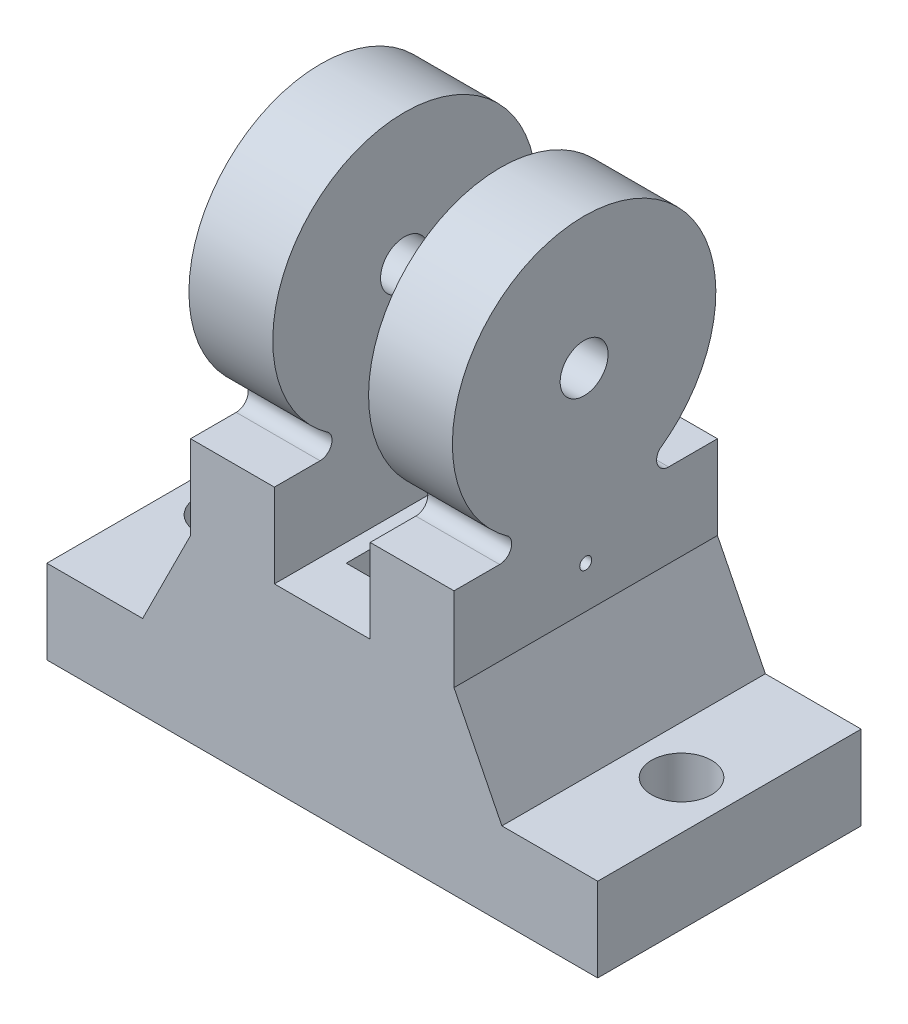
ISO-10303-21;
HEADER;
FILE_DESCRIPTION(('STEP AP214'),'2;1');
FILE_NAME('part.step','',(''),(''),'','','');
FILE_SCHEMA(('AUTOMOTIVE_DESIGN { 1 0 10303 214 1 1 1 1 }'));
ENDSEC;
DATA;
#1=APPLICATION_CONTEXT('core data for automotive mechanical design processes');
#2=APPLICATION_PROTOCOL_DEFINITION('international standard','automotive_design',2000,#1);
#3=PRODUCT_CONTEXT('',#1,'mechanical');
#4=PRODUCT('Part','Part','',(#3));
#5=PRODUCT_RELATED_PRODUCT_CATEGORY('part','',(#4));
#6=PRODUCT_DEFINITION_FORMATION('','',#4);
#7=PRODUCT_DEFINITION_CONTEXT('part definition',#1,'design');
#8=PRODUCT_DEFINITION('design','',#6,#7);
#9=PRODUCT_DEFINITION_SHAPE('','',#8);
#10=(LENGTH_UNIT() NAMED_UNIT(*) SI_UNIT(.MILLI.,.METRE.));
#11=(NAMED_UNIT(*) PLANE_ANGLE_UNIT() SI_UNIT($,.RADIAN.));
#12=(NAMED_UNIT(*) SI_UNIT($,.STERADIAN.) SOLID_ANGLE_UNIT());
#13=UNCERTAINTY_MEASURE_WITH_UNIT(LENGTH_MEASURE(1.E-05),#10,'distance_accuracy_value','');
#14=(GEOMETRIC_REPRESENTATION_CONTEXT(3) GLOBAL_UNCERTAINTY_ASSIGNED_CONTEXT((#13)) GLOBAL_UNIT_ASSIGNED_CONTEXT((#10,
#11,#12)) REPRESENTATION_CONTEXT('',''));
#15=CARTESIAN_POINT('',(0.,0.,0.));
#16=DIRECTION('',(0.,0.,1.));
#17=DIRECTION('',(1.,0.,0.));
#18=AXIS2_PLACEMENT_3D('',#15,#16,#17);
#19=CARTESIAN_POINT('',(-11.,20.,-11.));
#20=DIRECTION('',(1.,0.,0.));
#21=DIRECTION('',(0.,0.,-1.));
#22=AXIS2_PLACEMENT_3D('',#19,#20,#21);
#23=PLANE('',#22);
#24=CARTESIAN_POINT('',(-11.,18.5,0.));
#25=DIRECTION('',(-1.,0.,0.));
#26=DIRECTION('',(0.,0.,1.));
#27=AXIS2_PLACEMENT_3D('',#24,#25,#26);
#28=CIRCLE('',#27,0.5);
#29=CARTESIAN_POINT('',(-11.,18.5,0.499999999999998));
#30=VERTEX_POINT('',#29);
#31=EDGE_CURVE('E471',#30,#30,#28,.T.);
#32=ORIENTED_EDGE('',*,*,#31,.F.);
#33=EDGE_LOOP('',(#32));
#34=FACE_BOUND('',#33,.T.);
#35=CARTESIAN_POINT('',(-11.,32.6729866599634,0.134506770283667));
#36=DIRECTION('',(1.,0.,0.));
#37=DIRECTION('',(0.,0.,-1.));
#38=AXIS2_PLACEMENT_3D('',#35,#36,#37);
#39=CIRCLE('',#38,2.);
#40=CARTESIAN_POINT('',(-11.,32.6729866599634,-1.86549322971633));
#41=VERTEX_POINT('',#40);
#42=EDGE_CURVE('E309',#41,#41,#39,.T.);
#43=ORIENTED_EDGE('',*,*,#42,.T.);
#44=EDGE_LOOP('',(#43));
#45=FACE_BOUND('',#44,.T.);
#46=DIRECTION('',(0.,0.,-1.));
#47=VECTOR('',#46,1.);
#48=CARTESIAN_POINT('',(-11.,15.,11.));
#49=LINE('',#48,#47);
#50=CARTESIAN_POINT('',(-11.,15.,11.));
#51=VERTEX_POINT('',#50);
#52=CARTESIAN_POINT('',(-11.,15.,-11.));
#53=VERTEX_POINT('',#52);
#54=EDGE_CURVE('E305',#51,#53,#49,.T.);
#55=ORIENTED_EDGE('',*,*,#54,.F.);
#56=DIRECTION('',(0.,-1.,0.));
#57=VECTOR('',#56,1.);
#58=CARTESIAN_POINT('',(-11.,20.,11.));
#59=LINE('',#58,#57);
#60=CARTESIAN_POINT('',(-11.,22.,11.));
#61=VERTEX_POINT('',#60);
#62=EDGE_CURVE('E11',#61,#51,#59,.T.);
#63=ORIENTED_EDGE('',*,*,#62,.F.);
#64=DIRECTION('',(0.,0.,1.));
#65=VECTOR('',#64,1.);
#66=CARTESIAN_POINT('',(-11.,22.,11.));
#67=LINE('',#66,#65);
#68=CARTESIAN_POINT('',(-11.,22.,7.18833813213152));
#69=VERTEX_POINT('',#68);
#70=EDGE_CURVE('E332',#69,#61,#67,.T.);
#71=ORIENTED_EDGE('',*,*,#70,.F.);
#72=CARTESIAN_POINT('',(-11.,23.,7.18833813213152));
#73=DIRECTION('',(-1.,0.,0.));
#74=DIRECTION('',(0.,0.,-1.));
#75=AXIS2_PLACEMENT_3D('',#72,#73,#74);
#76=CIRCLE('',#75,1.);
#77=CARTESIAN_POINT('',(-11.,23.6538002685187,6.4316709603282));
#78=VERTEX_POINT('',#77);
#79=EDGE_CURVE('E329',#78,#69,#76,.T.);
#80=ORIENTED_EDGE('',*,*,#79,.F.);
#81=CARTESIAN_POINT('',(-11.,32.6729866599634,0.134506770283662));
#82=DIRECTION('',(1.,0.,0.));
#83=DIRECTION('',(0.,0.,-1.));
#84=AXIS2_PLACEMENT_3D('',#81,#82,#83);
#85=CIRCLE('',#84,11.);
#86=CARTESIAN_POINT('',(-11.,23.6538002685187,-6.16265741976087));
#87=VERTEX_POINT('',#86);
#88=EDGE_CURVE('E326',#87,#78,#85,.T.);
#89=ORIENTED_EDGE('',*,*,#88,.F.);
#90=CARTESIAN_POINT('',(-11.,23.,-6.91932459156419));
#91=DIRECTION('',(-1.,0.,0.));
#92=DIRECTION('',(0.,0.,-1.));
#93=AXIS2_PLACEMENT_3D('',#90,#91,#92);
#94=CIRCLE('',#93,1.);
#95=CARTESIAN_POINT('',(-11.,22.,-6.91932459156419));
#96=VERTEX_POINT('',#95);
#97=EDGE_CURVE('E322',#96,#87,#94,.T.);
#98=ORIENTED_EDGE('',*,*,#97,.F.);
#99=DIRECTION('',(0.,0.,1.));
#100=VECTOR('',#99,1.);
#101=CARTESIAN_POINT('',(-11.,22.,-11.));
#102=LINE('',#101,#100);
#103=CARTESIAN_POINT('',(-11.,22.,-11.));
#104=VERTEX_POINT('',#103);
#105=EDGE_CURVE('E319',#104,#96,#102,.T.);
#106=ORIENTED_EDGE('',*,*,#105,.F.);
#107=DIRECTION('',(0.,-1.,0.));
#108=VECTOR('',#107,1.);
#109=CARTESIAN_POINT('',(-11.,20.,-11.));
#110=LINE('',#109,#108);
#111=EDGE_CURVE('E431',#104,#53,#110,.T.);
#112=ORIENTED_EDGE('',*,*,#111,.T.);
#113=EDGE_LOOP('',(#55,#63,#71,#80,#89,#98,#106,#112));
#114=FACE_BOUND('',#113,.T.);
#115=ADVANCED_FACE('F33',(#34,#45,#114),#23,.F.);
#116=CARTESIAN_POINT('',(-11.,20.,11.));
#117=DIRECTION('',(0.,0.,-1.));
#118=DIRECTION('',(-1.,0.,0.));
#119=AXIS2_PLACEMENT_3D('',#116,#117,#118);
#120=PLANE('',#119);
#121=DIRECTION('',(0.,-1.,0.));
#122=VECTOR('',#121,1.);
#123=CARTESIAN_POINT('',(-4.,20.,11.));
#124=LINE('',#123,#122);
#125=CARTESIAN_POINT('',(-3.99999999999999,22.,11.));
#126=VERTEX_POINT('',#125);
#127=CARTESIAN_POINT('',(-4.,15.,11.));
#128=VERTEX_POINT('',#127);
#129=EDGE_CURVE('E407',#126,#128,#124,.T.);
#130=ORIENTED_EDGE('',*,*,#129,.F.);
#131=DIRECTION('',(1.,0.,0.));
#132=VECTOR('',#131,1.);
#133=CARTESIAN_POINT('',(-11.,22.,11.));
#134=LINE('',#133,#132);
#135=EDGE_CURVE('E349',#61,#126,#134,.T.);
#136=ORIENTED_EDGE('',*,*,#135,.F.);
#137=ORIENTED_EDGE('',*,*,#62,.T.);
#138=DIRECTION('',(-0.447213595499958,-0.894427190999916,0.));
#139=VECTOR('',#138,1.);
#140=CARTESIAN_POINT('',(-11.,15.,11.));
#141=LINE('',#140,#139);
#142=CARTESIAN_POINT('',(-15.,7.,11.));
#143=VERTEX_POINT('',#142);
#144=EDGE_CURVE('E283',#51,#143,#141,.T.);
#145=ORIENTED_EDGE('',*,*,#144,.T.);
#146=DIRECTION('',(-1.,0.,0.));
#147=VECTOR('',#146,1.);
#148=CARTESIAN_POINT('',(-15.,7.,11.));
#149=LINE('',#148,#147);
#150=CARTESIAN_POINT('',(-23.,7.,11.));
#151=VERTEX_POINT('',#150);
#152=EDGE_CURVE('E285',#143,#151,#149,.T.);
#153=ORIENTED_EDGE('',*,*,#152,.T.);
#154=DIRECTION('',(0.,-1.,0.));
#155=VECTOR('',#154,1.);
#156=CARTESIAN_POINT('',(-23.,7.,11.));
#157=LINE('',#156,#155);
#158=CARTESIAN_POINT('',(-23.,0.,11.));
#159=VERTEX_POINT('',#158);
#160=EDGE_CURVE('E288',#151,#159,#157,.T.);
#161=ORIENTED_EDGE('',*,*,#160,.T.);
#162=DIRECTION('',(1.,0.,0.));
#163=VECTOR('',#162,1.);
#164=CARTESIAN_POINT('',(-11.,0.,11.));
#165=LINE('',#164,#163);
#166=CARTESIAN_POINT('',(23.,0.,11.));
#167=VERTEX_POINT('',#166);
#168=EDGE_CURVE('E426',#159,#167,#165,.T.);
#169=ORIENTED_EDGE('',*,*,#168,.T.);
#170=DIRECTION('',(0.,1.,0.));
#171=VECTOR('',#170,1.);
#172=CARTESIAN_POINT('',(23.,7.,11.));
#173=LINE('',#172,#171);
#174=CARTESIAN_POINT('',(23.,7.,11.));
#175=VERTEX_POINT('',#174);
#176=EDGE_CURVE('E259',#167,#175,#173,.T.);
#177=ORIENTED_EDGE('',*,*,#176,.T.);
#178=DIRECTION('',(-1.,0.,0.));
#179=VECTOR('',#178,1.);
#180=CARTESIAN_POINT('',(15.,7.,11.));
#181=LINE('',#180,#179);
#182=CARTESIAN_POINT('',(15.,7.,11.));
#183=VERTEX_POINT('',#182);
#184=EDGE_CURVE('E261',#175,#183,#181,.T.);
#185=ORIENTED_EDGE('',*,*,#184,.T.);
#186=DIRECTION('',(-0.447213595499958,0.894427190999916,0.));
#187=VECTOR('',#186,1.);
#188=CARTESIAN_POINT('',(11.,15.,11.));
#189=LINE('',#188,#187);
#190=CARTESIAN_POINT('',(11.,15.,11.));
#191=VERTEX_POINT('',#190);
#192=EDGE_CURVE('E264',#183,#191,#189,.T.);
#193=ORIENTED_EDGE('',*,*,#192,.T.);
#194=DIRECTION('',(0.,-1.,0.));
#195=VECTOR('',#194,1.);
#196=CARTESIAN_POINT('',(11.,20.,11.));
#197=LINE('',#196,#195);
#198=CARTESIAN_POINT('',(11.,22.,11.));
#199=VERTEX_POINT('',#198);
#200=EDGE_CURVE('E41',#199,#191,#197,.T.);
#201=ORIENTED_EDGE('',*,*,#200,.F.);
#202=DIRECTION('',(1.,0.,0.));
#203=VECTOR('',#202,1.);
#204=CARTESIAN_POINT('',(4.,22.,11.));
#205=LINE('',#204,#203);
#206=CARTESIAN_POINT('',(4.,22.,11.));
#207=VERTEX_POINT('',#206);
#208=EDGE_CURVE('E393',#207,#199,#205,.T.);
#209=ORIENTED_EDGE('',*,*,#208,.F.);
#210=DIRECTION('',(0.,-1.,0.));
#211=VECTOR('',#210,1.);
#212=CARTESIAN_POINT('',(4.,20.,11.));
#213=LINE('',#212,#211);
#214=CARTESIAN_POINT('',(4.,15.,11.));
#215=VERTEX_POINT('',#214);
#216=EDGE_CURVE('E396',#207,#215,#213,.T.);
#217=ORIENTED_EDGE('',*,*,#216,.T.);
#218=DIRECTION('',(1.,0.,0.));
#219=VECTOR('',#218,1.);
#220=CARTESIAN_POINT('',(-4.,15.,11.));
#221=LINE('',#220,#219);
#222=EDGE_CURVE('E416',#128,#215,#221,.T.);
#223=ORIENTED_EDGE('',*,*,#222,.F.);
#224=EDGE_LOOP('',(#130,#136,#137,#145,#153,#161,#169,#177,#185,#193,#201,#209,#217,#223));
#225=FACE_BOUND('',#224,.T.);
#226=ADVANCED_FACE('F461',(#225),#120,.F.);
#227=CARTESIAN_POINT('',(-11.,20.,-11.));
#228=DIRECTION('',(0.,0.,1.));
#229=DIRECTION('',(1.,0.,0.));
#230=AXIS2_PLACEMENT_3D('',#227,#228,#229);
#231=PLANE('',#230);
#232=DIRECTION('',(0.,1.,0.));
#233=VECTOR('',#232,1.);
#234=CARTESIAN_POINT('',(-4.,20.,-11.));
#235=LINE('',#234,#233);
#236=CARTESIAN_POINT('',(-4.,15.,-11.));
#237=VERTEX_POINT('',#236);
#238=CARTESIAN_POINT('',(-4.,22.,-11.));
#239=VERTEX_POINT('',#238);
#240=EDGE_CURVE('E414',#237,#239,#235,.T.);
#241=ORIENTED_EDGE('',*,*,#240,.F.);
#242=DIRECTION('',(1.,0.,0.));
#243=VECTOR('',#242,1.);
#244=CARTESIAN_POINT('',(-4.,15.,-11.));
#245=LINE('',#244,#243);
#246=CARTESIAN_POINT('',(4.,15.,-11.));
#247=VERTEX_POINT('',#246);
#248=EDGE_CURVE('E423',#237,#247,#245,.T.);
#249=ORIENTED_EDGE('',*,*,#248,.T.);
#250=DIRECTION('',(0.,1.,0.));
#251=VECTOR('',#250,1.);
#252=CARTESIAN_POINT('',(4.,20.,-11.));
#253=LINE('',#252,#251);
#254=CARTESIAN_POINT('',(4.,22.,-11.));
#255=VERTEX_POINT('',#254);
#256=EDGE_CURVE('E411',#247,#255,#253,.T.);
#257=ORIENTED_EDGE('',*,*,#256,.T.);
#258=DIRECTION('',(1.,0.,0.));
#259=VECTOR('',#258,1.);
#260=CARTESIAN_POINT('',(4.,22.,-11.));
#261=LINE('',#260,#259);
#262=CARTESIAN_POINT('',(11.,22.,-11.));
#263=VERTEX_POINT('',#262);
#264=EDGE_CURVE('E379',#255,#263,#261,.T.);
#265=ORIENTED_EDGE('',*,*,#264,.T.);
#266=DIRECTION('',(0.,-1.,0.));
#267=VECTOR('',#266,1.);
#268=CARTESIAN_POINT('',(11.,20.,-11.));
#269=LINE('',#268,#267);
#270=CARTESIAN_POINT('',(11.,15.,-11.));
#271=VERTEX_POINT('',#270);
#272=EDGE_CURVE('E433',#263,#271,#269,.T.);
#273=ORIENTED_EDGE('',*,*,#272,.T.);
#274=DIRECTION('',(-0.447213595499958,0.894427190999916,0.));
#275=VECTOR('',#274,1.);
#276=CARTESIAN_POINT('',(11.,15.,-11.));
#277=LINE('',#276,#275);
#278=CARTESIAN_POINT('',(15.,7.,-11.));
#279=VERTEX_POINT('',#278);
#280=EDGE_CURVE('E262',#279,#271,#277,.T.);
#281=ORIENTED_EDGE('',*,*,#280,.F.);
#282=DIRECTION('',(-1.,0.,0.));
#283=VECTOR('',#282,1.);
#284=CARTESIAN_POINT('',(15.,7.,-11.));
#285=LINE('',#284,#283);
#286=CARTESIAN_POINT('',(23.,7.,-11.));
#287=VERTEX_POINT('',#286);
#288=EDGE_CURVE('E268',#287,#279,#285,.T.);
#289=ORIENTED_EDGE('',*,*,#288,.F.);
#290=DIRECTION('',(0.,1.,0.));
#291=VECTOR('',#290,1.);
#292=CARTESIAN_POINT('',(23.,7.,-11.));
#293=LINE('',#292,#291);
#294=CARTESIAN_POINT('',(23.,0.,-11.));
#295=VERTEX_POINT('',#294);
#296=EDGE_CURVE('E250',#295,#287,#293,.T.);
#297=ORIENTED_EDGE('',*,*,#296,.F.);
#298=DIRECTION('',(-1.,0.,0.));
#299=VECTOR('',#298,1.);
#300=CARTESIAN_POINT('',(-11.,0.,-11.));
#301=LINE('',#300,#299);
#302=CARTESIAN_POINT('',(-23.,0.,-11.));
#303=VERTEX_POINT('',#302);
#304=EDGE_CURVE('E429',#295,#303,#301,.T.);
#305=ORIENTED_EDGE('',*,*,#304,.T.);
#306=DIRECTION('',(0.,-1.,0.));
#307=VECTOR('',#306,1.);
#308=CARTESIAN_POINT('',(-23.,7.,-11.));
#309=LINE('',#308,#307);
#310=CARTESIAN_POINT('',(-23.,7.,-11.));
#311=VERTEX_POINT('',#310);
#312=EDGE_CURVE('E286',#311,#303,#309,.T.);
#313=ORIENTED_EDGE('',*,*,#312,.F.);
#314=DIRECTION('',(-1.,0.,0.));
#315=VECTOR('',#314,1.);
#316=CARTESIAN_POINT('',(-15.,7.,-11.));
#317=LINE('',#316,#315);
#318=CARTESIAN_POINT('',(-15.,7.,-11.));
#319=VERTEX_POINT('',#318);
#320=EDGE_CURVE('E293',#319,#311,#317,.T.);
#321=ORIENTED_EDGE('',*,*,#320,.F.);
#322=DIRECTION('',(-0.447213595499958,-0.894427190999916,0.));
#323=VECTOR('',#322,1.);
#324=CARTESIAN_POINT('',(-11.,15.,-11.));
#325=LINE('',#324,#323);
#326=EDGE_CURVE('E282',#53,#319,#325,.T.);
#327=ORIENTED_EDGE('',*,*,#326,.F.);
#328=ORIENTED_EDGE('',*,*,#111,.F.);
#329=DIRECTION('',(1.,0.,0.));
#330=VECTOR('',#329,1.);
#331=CARTESIAN_POINT('',(-11.,22.,-11.));
#332=LINE('',#331,#330);
#333=EDGE_CURVE('E335',#104,#239,#332,.T.);
#334=ORIENTED_EDGE('',*,*,#333,.T.);
#335=EDGE_LOOP('',(#241,#249,#257,#265,#273,#281,#289,#297,#305,#313,#321,#327,#328,#334));
#336=FACE_BOUND('',#335,.T.);
#337=ADVANCED_FACE('F466',(#336),#231,.F.);
#338=CARTESIAN_POINT('',(11.,20.,-11.));
#339=DIRECTION('',(-1.,0.,0.));
#340=DIRECTION('',(0.,0.,1.));
#341=AXIS2_PLACEMENT_3D('',#338,#339,#340);
#342=PLANE('',#341);
#343=CARTESIAN_POINT('',(11.,18.5,0.));
#344=DIRECTION('',(-1.,0.,0.));
#345=DIRECTION('',(0.,0.,1.));
#346=AXIS2_PLACEMENT_3D('',#343,#344,#345);
#347=CIRCLE('',#346,0.5);
#348=CARTESIAN_POINT('',(11.,18.5,0.499999999999998));
#349=VERTEX_POINT('',#348);
#350=EDGE_CURVE('E231',#349,#349,#347,.T.);
#351=ORIENTED_EDGE('',*,*,#350,.T.);
#352=EDGE_LOOP('',(#351));
#353=FACE_BOUND('',#352,.T.);
#354=CARTESIAN_POINT('',(11.,32.6729866599634,0.13450677028366));
#355=DIRECTION('',(1.,0.,0.));
#356=DIRECTION('',(0.,0.,-1.));
#357=AXIS2_PLACEMENT_3D('',#354,#355,#356);
#358=CIRCLE('',#357,2.);
#359=CARTESIAN_POINT('',(11.,32.6729866599634,-1.86549322971634));
#360=VERTEX_POINT('',#359);
#361=EDGE_CURVE('E308',#360,#360,#358,.T.);
#362=ORIENTED_EDGE('',*,*,#361,.F.);
#363=EDGE_LOOP('',(#362));
#364=FACE_BOUND('',#363,.T.);
#365=ORIENTED_EDGE('',*,*,#200,.T.);
#366=DIRECTION('',(0.,0.,-1.));
#367=VECTOR('',#366,1.);
#368=CARTESIAN_POINT('',(11.,15.,11.));
#369=LINE('',#368,#367);
#370=EDGE_CURVE('E266',#191,#271,#369,.T.);
#371=ORIENTED_EDGE('',*,*,#370,.T.);
#372=ORIENTED_EDGE('',*,*,#272,.F.);
#373=DIRECTION('',(0.,0.,1.));
#374=VECTOR('',#373,1.);
#375=CARTESIAN_POINT('',(11.,22.,-11.));
#376=LINE('',#375,#374);
#377=CARTESIAN_POINT('',(11.,22.,-6.91932459156419));
#378=VERTEX_POINT('',#377);
#379=EDGE_CURVE('E352',#263,#378,#376,.T.);
#380=ORIENTED_EDGE('',*,*,#379,.T.);
#381=CARTESIAN_POINT('',(11.,23.,-6.91932459156419));
#382=DIRECTION('',(-1.,0.,0.));
#383=DIRECTION('',(0.,0.,-1.));
#384=AXIS2_PLACEMENT_3D('',#381,#382,#383);
#385=CIRCLE('',#384,1.);
#386=CARTESIAN_POINT('',(11.,23.6538002685187,-6.16265741976087));
#387=VERTEX_POINT('',#386);
#388=EDGE_CURVE('E382',#378,#387,#385,.T.);
#389=ORIENTED_EDGE('',*,*,#388,.T.);
#390=CARTESIAN_POINT('',(11.,32.6729866599634,0.13450677028366));
#391=DIRECTION('',(1.,0.,0.));
#392=DIRECTION('',(0.,0.,-1.));
#393=AXIS2_PLACEMENT_3D('',#390,#391,#392);
#394=CIRCLE('',#393,11.);
#395=CARTESIAN_POINT('',(11.,23.6538002685187,6.43167096032819));
#396=VERTEX_POINT('',#395);
#397=EDGE_CURVE('E385',#387,#396,#394,.T.);
#398=ORIENTED_EDGE('',*,*,#397,.T.);
#399=CARTESIAN_POINT('',(11.,23.,7.18833813213151));
#400=DIRECTION('',(-1.,0.,0.));
#401=DIRECTION('',(0.,0.,-1.));
#402=AXIS2_PLACEMENT_3D('',#399,#400,#401);
#403=CIRCLE('',#402,1.);
#404=CARTESIAN_POINT('',(11.,22.,7.18833813213151));
#405=VERTEX_POINT('',#404);
#406=EDGE_CURVE('E388',#396,#405,#403,.T.);
#407=ORIENTED_EDGE('',*,*,#406,.T.);
#408=DIRECTION('',(0.,0.,1.));
#409=VECTOR('',#408,1.);
#410=CARTESIAN_POINT('',(11.,22.,11.));
#411=LINE('',#410,#409);
#412=EDGE_CURVE('E367',#405,#199,#411,.T.);
#413=ORIENTED_EDGE('',*,*,#412,.T.);
#414=EDGE_LOOP('',(#365,#371,#372,#380,#389,#398,#407,#413));
#415=FACE_BOUND('',#414,.T.);
#416=ADVANCED_FACE('F509',(#353,#364,#415),#342,.F.);
#417=CARTESIAN_POINT('',(0.,0.,0.));
#418=DIRECTION('',(0.,1.,0.));
#419=DIRECTION('',(0.,0.,1.));
#420=AXIS2_PLACEMENT_3D('',#417,#418,#419);
#421=PLANE('',#420);
#422=DIRECTION('',(1.,0.,0.));
#423=VECTOR('',#422,1.);
#424=CARTESIAN_POINT('',(-2.5,0.,6.5));
#425=LINE('',#424,#423);
#426=CARTESIAN_POINT('',(-2.5,0.,6.5));
#427=VERTEX_POINT('',#426);
#428=CARTESIAN_POINT('',(2.5,0.,6.5));
#429=VERTEX_POINT('',#428);
#430=EDGE_CURVE('E215',#427,#429,#425,.T.);
#431=ORIENTED_EDGE('',*,*,#430,.T.);
#432=DIRECTION('',(0.,0.,-1.));
#433=VECTOR('',#432,1.);
#434=CARTESIAN_POINT('',(2.5,0.,6.5));
#435=LINE('',#434,#433);
#436=CARTESIAN_POINT('',(2.5,0.,-6.5));
#437=VERTEX_POINT('',#436);
#438=EDGE_CURVE('E209',#429,#437,#435,.T.);
#439=ORIENTED_EDGE('',*,*,#438,.T.);
#440=DIRECTION('',(-1.,0.,0.));
#441=VECTOR('',#440,1.);
#442=CARTESIAN_POINT('',(-2.5,0.,-6.5));
#443=LINE('',#442,#441);
#444=CARTESIAN_POINT('',(-2.5,0.,-6.5));
#445=VERTEX_POINT('',#444);
#446=EDGE_CURVE('E218',#437,#445,#443,.T.);
#447=ORIENTED_EDGE('',*,*,#446,.T.);
#448=DIRECTION('',(0.,0.,1.));
#449=VECTOR('',#448,1.);
#450=CARTESIAN_POINT('',(-2.5,0.,6.5));
#451=LINE('',#450,#449);
#452=EDGE_CURVE('E49',#445,#427,#451,.T.);
#453=ORIENTED_EDGE('',*,*,#452,.T.);
#454=EDGE_LOOP('',(#431,#439,#447,#453));
#455=FACE_BOUND('',#454,.T.);
#456=CARTESIAN_POINT('',(-19.,0.,0.));
#457=DIRECTION('',(0.,1.,0.));
#458=DIRECTION('',(0.,0.,1.));
#459=AXIS2_PLACEMENT_3D('',#456,#457,#458);
#460=CIRCLE('',#459,2.5);
#461=CARTESIAN_POINT('',(-19.,0.,2.5));
#462=VERTEX_POINT('',#461);
#463=EDGE_CURVE('E247',#462,#462,#460,.T.);
#464=ORIENTED_EDGE('',*,*,#463,.T.);
#465=EDGE_LOOP('',(#464));
#466=FACE_BOUND('',#465,.T.);
#467=CARTESIAN_POINT('',(19.,0.,0.));
#468=DIRECTION('',(0.,1.,0.));
#469=DIRECTION('',(0.,0.,-1.));
#470=AXIS2_PLACEMENT_3D('',#467,#468,#469);
#471=CIRCLE('',#470,2.5);
#472=CARTESIAN_POINT('',(19.,0.,-2.5));
#473=VERTEX_POINT('',#472);
#474=EDGE_CURVE('E254',#473,#473,#471,.T.);
#475=ORIENTED_EDGE('',*,*,#474,.T.);
#476=EDGE_LOOP('',(#475));
#477=FACE_BOUND('',#476,.T.);
#478=ORIENTED_EDGE('',*,*,#168,.F.);
#479=DIRECTION('',(0.,0.,-1.));
#480=VECTOR('',#479,1.);
#481=CARTESIAN_POINT('',(-23.,0.,11.));
#482=LINE('',#481,#480);
#483=EDGE_CURVE('E291',#159,#303,#482,.T.);
#484=ORIENTED_EDGE('',*,*,#483,.T.);
#485=ORIENTED_EDGE('',*,*,#304,.F.);
#486=DIRECTION('',(0.,0.,-1.));
#487=VECTOR('',#486,1.);
#488=CARTESIAN_POINT('',(23.,0.,11.));
#489=LINE('',#488,#487);
#490=EDGE_CURVE('E279',#167,#295,#489,.T.);
#491=ORIENTED_EDGE('',*,*,#490,.F.);
#492=EDGE_LOOP('',(#478,#484,#485,#491));
#493=FACE_BOUND('',#492,.T.);
#494=ADVANCED_FACE('F222',(#455,#466,#477,#493),#421,.F.);
#495=CARTESIAN_POINT('',(-4.,15.,11.));
#496=DIRECTION('',(0.,-1.,0.));
#497=DIRECTION('',(0.,0.,-1.));
#498=AXIS2_PLACEMENT_3D('',#495,#496,#497);
#499=PLANE('',#498);
#500=DIRECTION('',(-1.,0.,0.));
#501=VECTOR('',#500,1.);
#502=CARTESIAN_POINT('',(-2.5,15.,-6.5));
#503=LINE('',#502,#501);
#504=CARTESIAN_POINT('',(2.5,15.,-6.5));
#505=VERTEX_POINT('',#504);
#506=CARTESIAN_POINT('',(-2.5,15.,-6.5));
#507=VERTEX_POINT('',#506);
#508=EDGE_CURVE('E237',#505,#507,#503,.T.);
#509=ORIENTED_EDGE('',*,*,#508,.F.);
#510=DIRECTION('',(0.,0.,-1.));
#511=VECTOR('',#510,1.);
#512=CARTESIAN_POINT('',(2.5,15.,6.5));
#513=LINE('',#512,#511);
#514=CARTESIAN_POINT('',(2.5,15.,6.5));
#515=VERTEX_POINT('',#514);
#516=EDGE_CURVE('E57',#515,#505,#513,.T.);
#517=ORIENTED_EDGE('',*,*,#516,.F.);
#518=DIRECTION('',(1.,0.,0.));
#519=VECTOR('',#518,1.);
#520=CARTESIAN_POINT('',(-2.5,15.,6.5));
#521=LINE('',#520,#519);
#522=CARTESIAN_POINT('',(-2.5,15.,6.5));
#523=VERTEX_POINT('',#522);
#524=EDGE_CURVE('E225',#523,#515,#521,.T.);
#525=ORIENTED_EDGE('',*,*,#524,.F.);
#526=DIRECTION('',(0.,0.,1.));
#527=VECTOR('',#526,1.);
#528=CARTESIAN_POINT('',(-2.5,15.,6.5));
#529=LINE('',#528,#527);
#530=EDGE_CURVE('E228',#507,#523,#529,.T.);
#531=ORIENTED_EDGE('',*,*,#530,.F.);
#532=EDGE_LOOP('',(#509,#517,#525,#531));
#533=FACE_BOUND('',#532,.T.);
#534=DIRECTION('',(0.,0.,-1.));
#535=VECTOR('',#534,1.);
#536=CARTESIAN_POINT('',(4.,15.,11.));
#537=LINE('',#536,#535);
#538=EDGE_CURVE('E419',#215,#247,#537,.T.);
#539=ORIENTED_EDGE('',*,*,#538,.T.);
#540=ORIENTED_EDGE('',*,*,#248,.F.);
#541=DIRECTION('',(0.,0.,-1.));
#542=VECTOR('',#541,1.);
#543=CARTESIAN_POINT('',(-4.,15.,11.));
#544=LINE('',#543,#542);
#545=EDGE_CURVE('E410',#128,#237,#544,.T.);
#546=ORIENTED_EDGE('',*,*,#545,.F.);
#547=ORIENTED_EDGE('',*,*,#222,.T.);
#548=EDGE_LOOP('',(#539,#540,#546,#547));
#549=FACE_BOUND('',#548,.T.);
#550=ADVANCED_FACE('F535',(#533,#549),#499,.F.);
#551=CARTESIAN_POINT('',(-4.,0.,0.));
#552=DIRECTION('',(1.,0.,0.));
#553=DIRECTION('',(0.,0.,-1.));
#554=AXIS2_PLACEMENT_3D('',#551,#552,#553);
#555=PLANE('',#554);
#556=CARTESIAN_POINT('',(-4.,18.5,0.));
#557=DIRECTION('',(1.,0.,0.));
#558=DIRECTION('',(0.,0.,-1.));
#559=AXIS2_PLACEMENT_3D('',#556,#557,#558);
#560=CIRCLE('',#559,0.5);
#561=CARTESIAN_POINT('',(-4.,18.5,-0.500000000000002));
#562=VERTEX_POINT('',#561);
#563=EDGE_CURVE('E596',#562,#562,#560,.T.);
#564=ORIENTED_EDGE('',*,*,#563,.F.);
#565=EDGE_LOOP('',(#564));
#566=FACE_BOUND('',#565,.T.);
#567=CARTESIAN_POINT('',(-4.,32.6729866599634,0.134506770283665));
#568=DIRECTION('',(1.,0.,0.));
#569=DIRECTION('',(0.,0.,-1.));
#570=AXIS2_PLACEMENT_3D('',#567,#568,#569);
#571=CIRCLE('',#570,2.);
#572=CARTESIAN_POINT('',(-4.,32.6729866599634,-1.86549322971634));
#573=VERTEX_POINT('',#572);
#574=EDGE_CURVE('E315',#573,#573,#571,.T.);
#575=ORIENTED_EDGE('',*,*,#574,.F.);
#576=EDGE_LOOP('',(#575));
#577=FACE_BOUND('',#576,.T.);
#578=ORIENTED_EDGE('',*,*,#129,.T.);
#579=ORIENTED_EDGE('',*,*,#545,.T.);
#580=ORIENTED_EDGE('',*,*,#240,.T.);
#581=DIRECTION('',(0.,0.,1.));
#582=VECTOR('',#581,1.);
#583=CARTESIAN_POINT('',(-4.,22.,-11.));
#584=LINE('',#583,#582);
#585=CARTESIAN_POINT('',(-4.,22.,-6.91932459156419));
#586=VERTEX_POINT('',#585);
#587=EDGE_CURVE('E318',#239,#586,#584,.T.);
#588=ORIENTED_EDGE('',*,*,#587,.T.);
#589=CARTESIAN_POINT('',(-4.,23.,-6.91932459156419));
#590=DIRECTION('',(-1.,0.,0.));
#591=DIRECTION('',(0.,0.,-1.));
#592=AXIS2_PLACEMENT_3D('',#589,#590,#591);
#593=CIRCLE('',#592,1.);
#594=CARTESIAN_POINT('',(-4.,23.6538002685187,-6.16265741976087));
#595=VERTEX_POINT('',#594);
#596=EDGE_CURVE('E338',#586,#595,#593,.T.);
#597=ORIENTED_EDGE('',*,*,#596,.T.);
#598=CARTESIAN_POINT('',(-4.,32.6729866599634,0.13450677028366));
#599=DIRECTION('',(1.,0.,0.));
#600=DIRECTION('',(0.,0.,-1.));
#601=AXIS2_PLACEMENT_3D('',#598,#599,#600);
#602=CIRCLE('',#601,11.);
#603=CARTESIAN_POINT('',(-4.,23.6538002685187,6.43167096032819));
#604=VERTEX_POINT('',#603);
#605=EDGE_CURVE('E341',#595,#604,#602,.T.);
#606=ORIENTED_EDGE('',*,*,#605,.T.);
#607=CARTESIAN_POINT('',(-4.,23.,7.18833813213151));
#608=DIRECTION('',(-1.,0.,0.));
#609=DIRECTION('',(0.,0.,-1.));
#610=AXIS2_PLACEMENT_3D('',#607,#608,#609);
#611=CIRCLE('',#610,1.);
#612=CARTESIAN_POINT('',(-4.,22.,7.18833813213151));
#613=VERTEX_POINT('',#612);
#614=EDGE_CURVE('E344',#604,#613,#611,.T.);
#615=ORIENTED_EDGE('',*,*,#614,.T.);
#616=DIRECTION('',(0.,0.,1.));
#617=VECTOR('',#616,1.);
#618=CARTESIAN_POINT('',(-3.99999999999999,22.,11.));
#619=LINE('',#618,#617);
#620=EDGE_CURVE('E323',#613,#126,#619,.T.);
#621=ORIENTED_EDGE('',*,*,#620,.T.);
#622=EDGE_LOOP('',(#578,#579,#580,#588,#597,#606,#615,#621));
#623=FACE_BOUND('',#622,.T.);
#624=ADVANCED_FACE('F541',(#566,#577,#623),#555,.T.);
#625=CARTESIAN_POINT('',(4.,0.,0.));
#626=DIRECTION('',(1.,0.,0.));
#627=DIRECTION('',(0.,0.,-1.));
#628=AXIS2_PLACEMENT_3D('',#625,#626,#627);
#629=PLANE('',#628);
#630=CARTESIAN_POINT('',(4.,18.5,0.));
#631=DIRECTION('',(1.,0.,0.));
#632=DIRECTION('',(0.,0.,-1.));
#633=AXIS2_PLACEMENT_3D('',#630,#631,#632);
#634=CIRCLE('',#633,0.5);
#635=CARTESIAN_POINT('',(4.,18.5,-0.500000000000002));
#636=VERTEX_POINT('',#635);
#637=EDGE_CURVE('E36',#636,#636,#634,.T.);
#638=ORIENTED_EDGE('',*,*,#637,.T.);
#639=EDGE_LOOP('',(#638));
#640=FACE_BOUND('',#639,.T.);
#641=CARTESIAN_POINT('',(4.,32.6729866599634,0.134506770283662));
#642=DIRECTION('',(1.,0.,0.));
#643=DIRECTION('',(0.,0.,-1.));
#644=AXIS2_PLACEMENT_3D('',#641,#642,#643);
#645=CIRCLE('',#644,2.);
#646=CARTESIAN_POINT('',(4.,32.6729866599634,-1.86549322971634));
#647=VERTEX_POINT('',#646);
#648=EDGE_CURVE('E312',#647,#647,#645,.T.);
#649=ORIENTED_EDGE('',*,*,#648,.T.);
#650=EDGE_LOOP('',(#649));
#651=FACE_BOUND('',#650,.T.);
#652=ORIENTED_EDGE('',*,*,#216,.F.);
#653=DIRECTION('',(0.,0.,1.));
#654=VECTOR('',#653,1.);
#655=CARTESIAN_POINT('',(4.,22.,11.));
#656=LINE('',#655,#654);
#657=CARTESIAN_POINT('',(4.,22.,7.18833813213152));
#658=VERTEX_POINT('',#657);
#659=EDGE_CURVE('E376',#658,#207,#656,.T.);
#660=ORIENTED_EDGE('',*,*,#659,.F.);
#661=CARTESIAN_POINT('',(4.,23.,7.18833813213152));
#662=DIRECTION('',(-1.,0.,0.));
#663=DIRECTION('',(0.,0.,-1.));
#664=AXIS2_PLACEMENT_3D('',#661,#662,#663);
#665=CIRCLE('',#664,1.);
#666=CARTESIAN_POINT('',(4.,23.6538002685187,6.4316709603282));
#667=VERTEX_POINT('',#666);
#668=EDGE_CURVE('E373',#667,#658,#665,.T.);
#669=ORIENTED_EDGE('',*,*,#668,.F.);
#670=CARTESIAN_POINT('',(4.,32.6729866599634,0.134506770283662));
#671=DIRECTION('',(1.,0.,0.));
#672=DIRECTION('',(0.,0.,-1.));
#673=AXIS2_PLACEMENT_3D('',#670,#671,#672);
#674=CIRCLE('',#673,11.);
#675=CARTESIAN_POINT('',(4.,23.6538002685187,-6.16265741976087));
#676=VERTEX_POINT('',#675);
#677=EDGE_CURVE('E370',#676,#667,#674,.T.);
#678=ORIENTED_EDGE('',*,*,#677,.F.);
#679=CARTESIAN_POINT('',(4.,23.,-6.91932459156419));
#680=DIRECTION('',(-1.,0.,0.));
#681=DIRECTION('',(0.,0.,-1.));
#682=AXIS2_PLACEMENT_3D('',#679,#680,#681);
#683=CIRCLE('',#682,1.);
#684=CARTESIAN_POINT('',(4.,22.,-6.91932459156419));
#685=VERTEX_POINT('',#684);
#686=EDGE_CURVE('E366',#685,#676,#683,.T.);
#687=ORIENTED_EDGE('',*,*,#686,.F.);
#688=DIRECTION('',(0.,0.,1.));
#689=VECTOR('',#688,1.);
#690=CARTESIAN_POINT('',(4.,22.,-11.));
#691=LINE('',#690,#689);
#692=EDGE_CURVE('E363',#255,#685,#691,.T.);
#693=ORIENTED_EDGE('',*,*,#692,.F.);
#694=ORIENTED_EDGE('',*,*,#256,.F.);
#695=ORIENTED_EDGE('',*,*,#538,.F.);
#696=EDGE_LOOP('',(#652,#660,#669,#678,#687,#693,#694,#695));
#697=FACE_BOUND('',#696,.T.);
#698=ADVANCED_FACE('F440',(#640,#651,#697),#629,.F.);
#699=CARTESIAN_POINT('',(4.,22.,11.));
#700=DIRECTION('',(0.,1.,0.));
#701=DIRECTION('',(0.,0.,1.));
#702=AXIS2_PLACEMENT_3D('',#699,#700,#701);
#703=PLANE('',#702);
#704=ORIENTED_EDGE('',*,*,#412,.F.);
#705=DIRECTION('',(1.,0.,0.));
#706=VECTOR('',#705,1.);
#707=CARTESIAN_POINT('',(4.,22.,7.18833813213152));
#708=LINE('',#707,#706);
#709=EDGE_CURVE('E397',#658,#405,#708,.T.);
#710=ORIENTED_EDGE('',*,*,#709,.F.);
#711=ORIENTED_EDGE('',*,*,#659,.T.);
#712=ORIENTED_EDGE('',*,*,#208,.T.);
#713=EDGE_LOOP('',(#704,#710,#711,#712));
#714=FACE_BOUND('',#713,.T.);
#715=ADVANCED_FACE('F513',(#714),#703,.T.);
#716=CARTESIAN_POINT('',(4.,23.,7.18833813213152));
#717=DIRECTION('',(1.,0.,0.));
#718=DIRECTION('',(0.,0.,-1.));
#719=AXIS2_PLACEMENT_3D('',#716,#717,#718);
#720=CYLINDRICAL_SURFACE('',#719,1.);
#721=ORIENTED_EDGE('',*,*,#406,.F.);
#722=DIRECTION('',(1.,0.,0.));
#723=VECTOR('',#722,1.);
#724=CARTESIAN_POINT('',(4.,23.6538002685187,6.4316709603282));
#725=LINE('',#724,#723);
#726=EDGE_CURVE('E399',#667,#396,#725,.T.);
#727=ORIENTED_EDGE('',*,*,#726,.F.);
#728=ORIENTED_EDGE('',*,*,#668,.T.);
#729=ORIENTED_EDGE('',*,*,#709,.T.);
#730=EDGE_LOOP('',(#721,#727,#728,#729));
#731=FACE_BOUND('',#730,.T.);
#732=ADVANCED_FACE('F520',(#731),#720,.F.);
#733=CARTESIAN_POINT('',(4.,32.6729866599634,0.134506770283662));
#734=DIRECTION('',(1.,0.,0.));
#735=DIRECTION('',(0.,0.,-1.));
#736=AXIS2_PLACEMENT_3D('',#733,#734,#735);
#737=CYLINDRICAL_SURFACE('',#736,11.);
#738=ORIENTED_EDGE('',*,*,#397,.F.);
#739=DIRECTION('',(1.,0.,0.));
#740=VECTOR('',#739,1.);
#741=CARTESIAN_POINT('',(4.,23.6538002685187,-6.16265741976087));
#742=LINE('',#741,#740);
#743=EDGE_CURVE('E401',#676,#387,#742,.T.);
#744=ORIENTED_EDGE('',*,*,#743,.F.);
#745=ORIENTED_EDGE('',*,*,#677,.T.);
#746=ORIENTED_EDGE('',*,*,#726,.T.);
#747=EDGE_LOOP('',(#738,#744,#745,#746));
#748=FACE_BOUND('',#747,.T.);
#749=ADVANCED_FACE('F523',(#748),#737,.T.);
#750=CARTESIAN_POINT('',(4.,23.,-6.91932459156419));
#751=DIRECTION('',(1.,0.,0.));
#752=DIRECTION('',(0.,0.,-1.));
#753=AXIS2_PLACEMENT_3D('',#750,#751,#752);
#754=CYLINDRICAL_SURFACE('',#753,1.);
#755=ORIENTED_EDGE('',*,*,#388,.F.);
#756=DIRECTION('',(1.,0.,0.));
#757=VECTOR('',#756,1.);
#758=CARTESIAN_POINT('',(4.,22.,-6.91932459156419));
#759=LINE('',#758,#757);
#760=EDGE_CURVE('E403',#685,#378,#759,.T.);
#761=ORIENTED_EDGE('',*,*,#760,.F.);
#762=ORIENTED_EDGE('',*,*,#686,.T.);
#763=ORIENTED_EDGE('',*,*,#743,.T.);
#764=EDGE_LOOP('',(#755,#761,#762,#763));
#765=FACE_BOUND('',#764,.T.);
#766=ADVANCED_FACE('F528',(#765),#754,.F.);
#767=CARTESIAN_POINT('',(4.,22.,-11.));
#768=DIRECTION('',(0.,1.,0.));
#769=DIRECTION('',(0.,0.,1.));
#770=AXIS2_PLACEMENT_3D('',#767,#768,#769);
#771=PLANE('',#770);
#772=ORIENTED_EDGE('',*,*,#379,.F.);
#773=ORIENTED_EDGE('',*,*,#264,.F.);
#774=ORIENTED_EDGE('',*,*,#692,.T.);
#775=ORIENTED_EDGE('',*,*,#760,.T.);
#776=EDGE_LOOP('',(#772,#773,#774,#775));
#777=FACE_BOUND('',#776,.T.);
#778=ADVANCED_FACE('F531',(#777),#771,.T.);
#779=CARTESIAN_POINT('',(-11.,22.,11.));
#780=DIRECTION('',(0.,1.,0.));
#781=DIRECTION('',(0.,0.,1.));
#782=AXIS2_PLACEMENT_3D('',#779,#780,#781);
#783=PLANE('',#782);
#784=ORIENTED_EDGE('',*,*,#620,.F.);
#785=DIRECTION('',(1.,0.,0.));
#786=VECTOR('',#785,1.);
#787=CARTESIAN_POINT('',(-11.,22.,7.18833813213152));
#788=LINE('',#787,#786);
#789=EDGE_CURVE('E353',#69,#613,#788,.T.);
#790=ORIENTED_EDGE('',*,*,#789,.F.);
#791=ORIENTED_EDGE('',*,*,#70,.T.);
#792=ORIENTED_EDGE('',*,*,#135,.T.);
#793=EDGE_LOOP('',(#784,#790,#791,#792));
#794=FACE_BOUND('',#793,.T.);
#795=ADVANCED_FACE('F544',(#794),#783,.T.);
#796=CARTESIAN_POINT('',(-11.,23.,7.18833813213152));
#797=DIRECTION('',(1.,0.,0.));
#798=DIRECTION('',(0.,0.,-1.));
#799=AXIS2_PLACEMENT_3D('',#796,#797,#798);
#800=CYLINDRICAL_SURFACE('',#799,1.);
#801=ORIENTED_EDGE('',*,*,#614,.F.);
#802=DIRECTION('',(1.,0.,0.));
#803=VECTOR('',#802,1.);
#804=CARTESIAN_POINT('',(-11.,23.6538002685187,6.4316709603282));
#805=LINE('',#804,#803);
#806=EDGE_CURVE('E355',#78,#604,#805,.T.);
#807=ORIENTED_EDGE('',*,*,#806,.F.);
#808=ORIENTED_EDGE('',*,*,#79,.T.);
#809=ORIENTED_EDGE('',*,*,#789,.T.);
#810=EDGE_LOOP('',(#801,#807,#808,#809));
#811=FACE_BOUND('',#810,.T.);
#812=ADVANCED_FACE('F549',(#811),#800,.F.);
#813=CARTESIAN_POINT('',(-11.,32.6729866599634,0.134506770283662));
#814=DIRECTION('',(1.,0.,0.));
#815=DIRECTION('',(0.,0.,-1.));
#816=AXIS2_PLACEMENT_3D('',#813,#814,#815);
#817=CYLINDRICAL_SURFACE('',#816,11.);
#818=ORIENTED_EDGE('',*,*,#605,.F.);
#819=DIRECTION('',(1.,0.,0.));
#820=VECTOR('',#819,1.);
#821=CARTESIAN_POINT('',(-11.,23.6538002685187,-6.16265741976087));
#822=LINE('',#821,#820);
#823=EDGE_CURVE('E357',#87,#595,#822,.T.);
#824=ORIENTED_EDGE('',*,*,#823,.F.);
#825=ORIENTED_EDGE('',*,*,#88,.T.);
#826=ORIENTED_EDGE('',*,*,#806,.T.);
#827=EDGE_LOOP('',(#818,#824,#825,#826));
#828=FACE_BOUND('',#827,.T.);
#829=ADVANCED_FACE('F552',(#828),#817,.T.);
#830=CARTESIAN_POINT('',(-11.,23.,-6.91932459156419));
#831=DIRECTION('',(1.,0.,0.));
#832=DIRECTION('',(0.,0.,-1.));
#833=AXIS2_PLACEMENT_3D('',#830,#831,#832);
#834=CYLINDRICAL_SURFACE('',#833,1.);
#835=ORIENTED_EDGE('',*,*,#596,.F.);
#836=DIRECTION('',(1.,0.,0.));
#837=VECTOR('',#836,1.);
#838=CARTESIAN_POINT('',(-11.,22.,-6.91932459156419));
#839=LINE('',#838,#837);
#840=EDGE_CURVE('E359',#96,#586,#839,.T.);
#841=ORIENTED_EDGE('',*,*,#840,.F.);
#842=ORIENTED_EDGE('',*,*,#97,.T.);
#843=ORIENTED_EDGE('',*,*,#823,.T.);
#844=EDGE_LOOP('',(#835,#841,#842,#843));
#845=FACE_BOUND('',#844,.T.);
#846=ADVANCED_FACE('F455',(#845),#834,.F.);
#847=CARTESIAN_POINT('',(-11.,22.,-11.));
#848=DIRECTION('',(0.,1.,0.));
#849=DIRECTION('',(0.,0.,1.));
#850=AXIS2_PLACEMENT_3D('',#847,#848,#849);
#851=PLANE('',#850);
#852=ORIENTED_EDGE('',*,*,#587,.F.);
#853=ORIENTED_EDGE('',*,*,#333,.F.);
#854=ORIENTED_EDGE('',*,*,#105,.T.);
#855=ORIENTED_EDGE('',*,*,#840,.T.);
#856=EDGE_LOOP('',(#852,#853,#854,#855));
#857=FACE_BOUND('',#856,.T.);
#858=ADVANCED_FACE('F446',(#857),#851,.T.);
#859=CARTESIAN_POINT('',(-11.,32.6729866599634,0.134506770283667));
#860=DIRECTION('',(1.,0.,0.));
#861=DIRECTION('',(0.,0.,-1.));
#862=AXIS2_PLACEMENT_3D('',#859,#860,#861);
#863=CYLINDRICAL_SURFACE('',#862,2.);
#864=ORIENTED_EDGE('',*,*,#361,.T.);
#865=EDGE_LOOP('',(#864));
#866=FACE_BOUND('',#865,.T.);
#867=ORIENTED_EDGE('',*,*,#648,.F.);
#868=EDGE_LOOP('',(#867));
#869=FACE_BOUND('',#868,.T.);
#870=ADVANCED_FACE('F443',(#866,#869),#863,.F.);
#871=ORIENTED_EDGE('',*,*,#574,.T.);
#872=EDGE_LOOP('',(#871));
#873=FACE_BOUND('',#872,.T.);
#874=ORIENTED_EDGE('',*,*,#42,.F.);
#875=EDGE_LOOP('',(#874));
#876=FACE_BOUND('',#875,.T.);
#877=ADVANCED_FACE('F445',(#873,#876),#863,.F.);
#878=CARTESIAN_POINT('',(-11.,15.,11.));
#879=DIRECTION('',(0.894427190999916,-0.447213595499958,0.));
#880=DIRECTION('',(0.447213595499958,0.894427190999916,0.));
#881=AXIS2_PLACEMENT_3D('',#878,#879,#880);
#882=PLANE('',#881);
#883=ORIENTED_EDGE('',*,*,#326,.T.);
#884=DIRECTION('',(0.,0.,-1.));
#885=VECTOR('',#884,1.);
#886=CARTESIAN_POINT('',(-15.,7.,11.));
#887=LINE('',#886,#885);
#888=EDGE_CURVE('E302',#143,#319,#887,.T.);
#889=ORIENTED_EDGE('',*,*,#888,.F.);
#890=ORIENTED_EDGE('',*,*,#144,.F.);
#891=ORIENTED_EDGE('',*,*,#54,.T.);
#892=EDGE_LOOP('',(#883,#889,#890,#891));
#893=FACE_BOUND('',#892,.T.);
#894=ADVANCED_FACE('F453',(#893),#882,.F.);
#895=CARTESIAN_POINT('',(-15.,7.,11.));
#896=DIRECTION('',(0.,-1.,0.));
#897=DIRECTION('',(1.,0.,0.));
#898=AXIS2_PLACEMENT_3D('',#895,#896,#897);
#899=PLANE('',#898);
#900=CARTESIAN_POINT('',(-19.,7.,0.));
#901=DIRECTION('',(0.,1.,0.));
#902=DIRECTION('',(0.,0.,1.));
#903=AXIS2_PLACEMENT_3D('',#900,#901,#902);
#904=CIRCLE('',#903,2.5);
#905=CARTESIAN_POINT('',(-19.,7.,2.5));
#906=VERTEX_POINT('',#905);
#907=EDGE_CURVE('E251',#906,#906,#904,.T.);
#908=ORIENTED_EDGE('',*,*,#907,.F.);
#909=EDGE_LOOP('',(#908));
#910=FACE_BOUND('',#909,.T.);
#911=ORIENTED_EDGE('',*,*,#320,.T.);
#912=DIRECTION('',(0.,0.,-1.));
#913=VECTOR('',#912,1.);
#914=CARTESIAN_POINT('',(-23.,7.,11.));
#915=LINE('',#914,#913);
#916=EDGE_CURVE('E299',#151,#311,#915,.T.);
#917=ORIENTED_EDGE('',*,*,#916,.F.);
#918=ORIENTED_EDGE('',*,*,#152,.F.);
#919=ORIENTED_EDGE('',*,*,#888,.T.);
#920=EDGE_LOOP('',(#911,#917,#918,#919));
#921=FACE_BOUND('',#920,.T.);
#922=ADVANCED_FACE('F485',(#910,#921),#899,.F.);
#923=CARTESIAN_POINT('',(-23.,7.,11.));
#924=DIRECTION('',(1.,0.,0.));
#925=DIRECTION('',(0.,0.,-1.));
#926=AXIS2_PLACEMENT_3D('',#923,#924,#925);
#927=PLANE('',#926);
#928=ORIENTED_EDGE('',*,*,#312,.T.);
#929=ORIENTED_EDGE('',*,*,#483,.F.);
#930=ORIENTED_EDGE('',*,*,#160,.F.);
#931=ORIENTED_EDGE('',*,*,#916,.T.);
#932=EDGE_LOOP('',(#928,#929,#930,#931));
#933=FACE_BOUND('',#932,.T.);
#934=ADVANCED_FACE('F490',(#933),#927,.F.);
#935=CARTESIAN_POINT('',(23.,7.,11.));
#936=DIRECTION('',(-1.,0.,0.));
#937=DIRECTION('',(0.,0.,1.));
#938=AXIS2_PLACEMENT_3D('',#935,#936,#937);
#939=PLANE('',#938);
#940=ORIENTED_EDGE('',*,*,#296,.T.);
#941=DIRECTION('',(0.,0.,-1.));
#942=VECTOR('',#941,1.);
#943=CARTESIAN_POINT('',(23.,7.,11.));
#944=LINE('',#943,#942);
#945=EDGE_CURVE('E276',#175,#287,#944,.T.);
#946=ORIENTED_EDGE('',*,*,#945,.F.);
#947=ORIENTED_EDGE('',*,*,#176,.F.);
#948=ORIENTED_EDGE('',*,*,#490,.T.);
#949=EDGE_LOOP('',(#940,#946,#947,#948));
#950=FACE_BOUND('',#949,.T.);
#951=ADVANCED_FACE('F497',(#950),#939,.F.);
#952=CARTESIAN_POINT('',(15.,7.,11.));
#953=DIRECTION('',(0.,-1.,0.));
#954=DIRECTION('',(1.,0.,0.));
#955=AXIS2_PLACEMENT_3D('',#952,#953,#954);
#956=PLANE('',#955);
#957=CARTESIAN_POINT('',(19.,7.,0.));
#958=DIRECTION('',(0.,1.,0.));
#959=DIRECTION('',(0.,0.,-1.));
#960=AXIS2_PLACEMENT_3D('',#957,#958,#959);
#961=CIRCLE('',#960,2.5);
#962=CARTESIAN_POINT('',(19.,7.,-2.5));
#963=VERTEX_POINT('',#962);
#964=EDGE_CURVE('E243',#963,#963,#961,.T.);
#965=ORIENTED_EDGE('',*,*,#964,.F.);
#966=EDGE_LOOP('',(#965));
#967=FACE_BOUND('',#966,.T.);
#968=ORIENTED_EDGE('',*,*,#288,.T.);
#969=DIRECTION('',(0.,0.,-1.));
#970=VECTOR('',#969,1.);
#971=CARTESIAN_POINT('',(15.,7.,11.));
#972=LINE('',#971,#970);
#973=EDGE_CURVE('E273',#183,#279,#972,.T.);
#974=ORIENTED_EDGE('',*,*,#973,.F.);
#975=ORIENTED_EDGE('',*,*,#184,.F.);
#976=ORIENTED_EDGE('',*,*,#945,.T.);
#977=EDGE_LOOP('',(#968,#974,#975,#976));
#978=FACE_BOUND('',#977,.T.);
#979=ADVANCED_FACE('F503',(#967,#978),#956,.F.);
#980=CARTESIAN_POINT('',(11.,15.,11.));
#981=DIRECTION('',(-0.894427190999916,-0.447213595499958,0.));
#982=DIRECTION('',(0.447213595499958,-0.894427190999916,0.));
#983=AXIS2_PLACEMENT_3D('',#980,#981,#982);
#984=PLANE('',#983);
#985=ORIENTED_EDGE('',*,*,#280,.T.);
#986=ORIENTED_EDGE('',*,*,#370,.F.);
#987=ORIENTED_EDGE('',*,*,#192,.F.);
#988=ORIENTED_EDGE('',*,*,#973,.T.);
#989=EDGE_LOOP('',(#985,#986,#987,#988));
#990=FACE_BOUND('',#989,.T.);
#991=ADVANCED_FACE('F507',(#990),#984,.F.);
#992=CARTESIAN_POINT('',(19.,0.,0.));
#993=DIRECTION('',(0.,1.,0.));
#994=DIRECTION('',(0.,0.,1.));
#995=AXIS2_PLACEMENT_3D('',#992,#993,#994);
#996=CYLINDRICAL_SURFACE('',#995,2.5);
#997=ORIENTED_EDGE('',*,*,#474,.F.);
#998=EDGE_LOOP('',(#997));
#999=FACE_BOUND('',#998,.T.);
#1000=ORIENTED_EDGE('',*,*,#964,.T.);
#1001=EDGE_LOOP('',(#1000));
#1002=FACE_BOUND('',#1001,.T.);
#1003=ADVANCED_FACE('F626',(#999,#1002),#996,.F.);
#1004=CARTESIAN_POINT('',(-19.,0.,0.));
#1005=DIRECTION('',(0.,1.,0.));
#1006=DIRECTION('',(0.,0.,1.));
#1007=AXIS2_PLACEMENT_3D('',#1004,#1005,#1006);
#1008=CYLINDRICAL_SURFACE('',#1007,2.5);
#1009=ORIENTED_EDGE('',*,*,#463,.F.);
#1010=EDGE_LOOP('',(#1009));
#1011=FACE_BOUND('',#1010,.T.);
#1012=ORIENTED_EDGE('',*,*,#907,.T.);
#1013=EDGE_LOOP('',(#1012));
#1014=FACE_BOUND('',#1013,.T.);
#1015=ADVANCED_FACE('F623',(#1011,#1014),#1008,.F.);
#1016=CARTESIAN_POINT('',(2.5,0.,6.5));
#1017=DIRECTION('',(1.,0.,0.));
#1018=DIRECTION('',(0.,0.,-1.));
#1019=AXIS2_PLACEMENT_3D('',#1016,#1017,#1018);
#1020=PLANE('',#1019);
#1021=ORIENTED_EDGE('',*,*,#516,.T.);
#1022=DIRECTION('',(0.,1.,0.));
#1023=VECTOR('',#1022,1.);
#1024=CARTESIAN_POINT('',(2.5,0.,-6.5));
#1025=LINE('',#1024,#1023);
#1026=EDGE_CURVE('E205',#437,#505,#1025,.T.);
#1027=ORIENTED_EDGE('',*,*,#1026,.F.);
#1028=ORIENTED_EDGE('',*,*,#438,.F.);
#1029=DIRECTION('',(0.,1.,0.));
#1030=VECTOR('',#1029,1.);
#1031=CARTESIAN_POINT('',(2.5,0.,6.5));
#1032=LINE('',#1031,#1030);
#1033=EDGE_CURVE('E241',#429,#515,#1032,.T.);
#1034=ORIENTED_EDGE('',*,*,#1033,.T.);
#1035=EDGE_LOOP('',(#1021,#1027,#1028,#1034));
#1036=FACE_BOUND('',#1035,.T.);
#1037=ADVANCED_FACE('F207',(#1036),#1020,.F.);
#1038=CARTESIAN_POINT('',(-2.5,0.,6.5));
#1039=DIRECTION('',(0.,0.,1.));
#1040=DIRECTION('',(1.,0.,0.));
#1041=AXIS2_PLACEMENT_3D('',#1038,#1039,#1040);
#1042=PLANE('',#1041);
#1043=ORIENTED_EDGE('',*,*,#524,.T.);
#1044=ORIENTED_EDGE('',*,*,#1033,.F.);
#1045=ORIENTED_EDGE('',*,*,#430,.F.);
#1046=DIRECTION('',(0.,1.,0.));
#1047=VECTOR('',#1046,1.);
#1048=CARTESIAN_POINT('',(-2.5,0.,6.5));
#1049=LINE('',#1048,#1047);
#1050=EDGE_CURVE('E244',#427,#523,#1049,.T.);
#1051=ORIENTED_EDGE('',*,*,#1050,.T.);
#1052=EDGE_LOOP('',(#1043,#1044,#1045,#1051));
#1053=FACE_BOUND('',#1052,.T.);
#1054=ADVANCED_FACE('F612',(#1053),#1042,.F.);
#1055=CARTESIAN_POINT('',(-2.5,0.,6.5));
#1056=DIRECTION('',(-1.,0.,0.));
#1057=DIRECTION('',(0.,0.,1.));
#1058=AXIS2_PLACEMENT_3D('',#1055,#1056,#1057);
#1059=PLANE('',#1058);
#1060=ORIENTED_EDGE('',*,*,#530,.T.);
#1061=ORIENTED_EDGE('',*,*,#1050,.F.);
#1062=ORIENTED_EDGE('',*,*,#452,.F.);
#1063=DIRECTION('',(0.,1.,0.));
#1064=VECTOR('',#1063,1.);
#1065=CARTESIAN_POINT('',(-2.5,0.,-6.5));
#1066=LINE('',#1065,#1064);
#1067=EDGE_CURVE('E214',#445,#507,#1066,.T.);
#1068=ORIENTED_EDGE('',*,*,#1067,.T.);
#1069=EDGE_LOOP('',(#1060,#1061,#1062,#1068));
#1070=FACE_BOUND('',#1069,.T.);
#1071=ADVANCED_FACE('F615',(#1070),#1059,.F.);
#1072=CARTESIAN_POINT('',(-2.5,0.,-6.5));
#1073=DIRECTION('',(0.,0.,-1.));
#1074=DIRECTION('',(-1.,0.,0.));
#1075=AXIS2_PLACEMENT_3D('',#1072,#1073,#1074);
#1076=PLANE('',#1075);
#1077=ORIENTED_EDGE('',*,*,#508,.T.);
#1078=ORIENTED_EDGE('',*,*,#1067,.F.);
#1079=ORIENTED_EDGE('',*,*,#446,.F.);
#1080=ORIENTED_EDGE('',*,*,#1026,.T.);
#1081=EDGE_LOOP('',(#1077,#1078,#1079,#1080));
#1082=FACE_BOUND('',#1081,.T.);
#1083=ADVANCED_FACE('F219',(#1082),#1076,.F.);
#1084=CARTESIAN_POINT('',(23.,18.5,0.));
#1085=DIRECTION('',(-1.,0.,0.));
#1086=DIRECTION('',(0.,0.,1.));
#1087=AXIS2_PLACEMENT_3D('',#1084,#1085,#1086);
#1088=CYLINDRICAL_SURFACE('',#1087,0.5);
#1089=ORIENTED_EDGE('',*,*,#637,.F.);
#1090=EDGE_LOOP('',(#1089));
#1091=FACE_BOUND('',#1090,.T.);
#1092=ORIENTED_EDGE('',*,*,#350,.F.);
#1093=EDGE_LOOP('',(#1092));
#1094=FACE_BOUND('',#1093,.T.);
#1095=ADVANCED_FACE('F605',(#1091,#1094),#1088,.F.);
#1096=ORIENTED_EDGE('',*,*,#563,.T.);
#1097=EDGE_LOOP('',(#1096));
#1098=FACE_BOUND('',#1097,.T.);
#1099=ORIENTED_EDGE('',*,*,#31,.T.);
#1100=EDGE_LOOP('',(#1099));
#1101=FACE_BOUND('',#1100,.T.);
#1102=ADVANCED_FACE('F603',(#1098,#1101),#1088,.F.);
#1103=CLOSED_SHELL('',(#115,#226,#337,#416,#494,#550,#624,#698,#715,#732,#749,#766,#778,#795,
#812,#829,#846,#858,#870,#877,#894,#922,#934,#951,#979,#991,#1003,#1015,#1037,#1054,#1071,#1083,
#1095,#1102));
#1104=MANIFOLD_SOLID_BREP('B2',#1103);
#1105=ADVANCED_BREP_SHAPE_REPRESENTATION('',(#18,#1104),#14);
#1106=SHAPE_DEFINITION_REPRESENTATION(#9,#1105);
ENDSEC;
END-ISO-10303-21;
